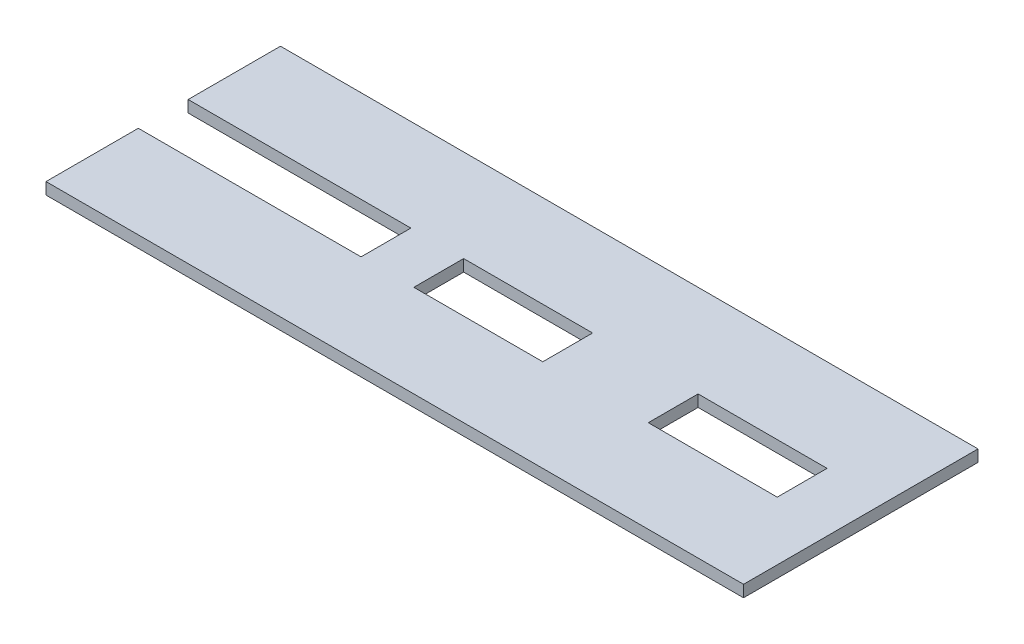
ISO-10303-21;
HEADER;
FILE_DESCRIPTION(('STEP AP214'),'2;1');
FILE_NAME('part.step','',(''),(''),'','','');
FILE_SCHEMA(('AUTOMOTIVE_DESIGN { 1 0 10303 214 1 1 1 1 }'));
ENDSEC;
DATA;
#1=APPLICATION_CONTEXT('core data for automotive mechanical design processes');
#2=APPLICATION_PROTOCOL_DEFINITION('international standard','automotive_design',2000,#1);
#3=PRODUCT_CONTEXT('',#1,'mechanical');
#4=PRODUCT('Part','Part','',(#3));
#5=PRODUCT_RELATED_PRODUCT_CATEGORY('part','',(#4));
#6=PRODUCT_DEFINITION_FORMATION('','',#4);
#7=PRODUCT_DEFINITION_CONTEXT('part definition',#1,'design');
#8=PRODUCT_DEFINITION('design','',#6,#7);
#9=PRODUCT_DEFINITION_SHAPE('','',#8);
#10=(LENGTH_UNIT() NAMED_UNIT(*) SI_UNIT(.MILLI.,.METRE.));
#11=(NAMED_UNIT(*) PLANE_ANGLE_UNIT() SI_UNIT($,.RADIAN.));
#12=(NAMED_UNIT(*) SI_UNIT($,.STERADIAN.) SOLID_ANGLE_UNIT());
#13=UNCERTAINTY_MEASURE_WITH_UNIT(LENGTH_MEASURE(1.E-05),#10,'distance_accuracy_value','');
#14=(GEOMETRIC_REPRESENTATION_CONTEXT(3) GLOBAL_UNCERTAINTY_ASSIGNED_CONTEXT((#13)) GLOBAL_UNIT_ASSIGNED_CONTEXT((#10,
#11,#12)) REPRESENTATION_CONTEXT('',''));
#15=CARTESIAN_POINT('',(0.,0.,0.));
#16=DIRECTION('',(0.,0.,1.));
#17=DIRECTION('',(1.,0.,0.));
#18=AXIS2_PLACEMENT_3D('',#15,#16,#17);
#19=CARTESIAN_POINT('',(0.,2.,0.));
#20=DIRECTION('',(1.,0.,0.));
#21=DIRECTION('',(0.,0.,-1.));
#22=AXIS2_PLACEMENT_3D('',#19,#20,#21);
#23=PLANE('',#22);
#24=DIRECTION('',(0.,0.,1.));
#25=VECTOR('',#24,1.);
#26=CARTESIAN_POINT('',(0.,0.,0.));
#27=LINE('',#26,#25);
#28=CARTESIAN_POINT('',(0.,0.,0.));
#29=VERTEX_POINT('',#28);
#30=CARTESIAN_POINT('',(0.,0.,15.75));
#31=VERTEX_POINT('',#30);
#32=EDGE_CURVE('E263',#29,#31,#27,.T.);
#33=ORIENTED_EDGE('',*,*,#32,.T.);
#34=DIRECTION('',(0.,1.,0.));
#35=VECTOR('',#34,1.);
#36=CARTESIAN_POINT('',(0.,0.,15.75));
#37=LINE('',#36,#35);
#38=CARTESIAN_POINT('',(0.,2.,15.75));
#39=VERTEX_POINT('',#38);
#40=EDGE_CURVE('E243',#31,#39,#37,.T.);
#41=ORIENTED_EDGE('',*,*,#40,.T.);
#42=DIRECTION('',(0.,0.,1.));
#43=VECTOR('',#42,1.);
#44=CARTESIAN_POINT('',(0.,2.,0.));
#45=LINE('',#44,#43);
#46=CARTESIAN_POINT('',(0.,2.,0.));
#47=VERTEX_POINT('',#46);
#48=EDGE_CURVE('E252',#47,#39,#45,.T.);
#49=ORIENTED_EDGE('',*,*,#48,.F.);
#50=DIRECTION('',(0.,-1.,0.));
#51=VECTOR('',#50,1.);
#52=CARTESIAN_POINT('',(0.,2.,0.));
#53=LINE('',#52,#51);
#54=EDGE_CURVE('E262',#47,#29,#53,.T.);
#55=ORIENTED_EDGE('',*,*,#54,.T.);
#56=EDGE_LOOP('',(#33,#41,#49,#55));
#57=FACE_BOUND('',#56,.T.);
#58=ADVANCED_FACE('F43',(#57),#23,.F.);
#59=CARTESIAN_POINT('',(0.,2.,24.25));
#60=VERTEX_POINT('',#59);
#61=CARTESIAN_POINT('',(0.,2.,40.));
#62=VERTEX_POINT('',#61);
#63=EDGE_CURVE('E256',#60,#62,#45,.T.);
#64=ORIENTED_EDGE('',*,*,#63,.F.);
#65=DIRECTION('',(0.,1.,0.));
#66=VECTOR('',#65,1.);
#67=CARTESIAN_POINT('',(0.,0.,24.25));
#68=LINE('',#67,#66);
#69=CARTESIAN_POINT('',(0.,0.,24.25));
#70=VERTEX_POINT('',#69);
#71=EDGE_CURVE('E236',#70,#60,#68,.T.);
#72=ORIENTED_EDGE('',*,*,#71,.F.);
#73=CARTESIAN_POINT('',(0.,0.,40.));
#74=VERTEX_POINT('',#73);
#75=EDGE_CURVE('E246',#70,#74,#27,.T.);
#76=ORIENTED_EDGE('',*,*,#75,.T.);
#77=DIRECTION('',(0.,-1.,0.));
#78=VECTOR('',#77,1.);
#79=CARTESIAN_POINT('',(0.,2.,40.));
#80=LINE('',#79,#78);
#81=EDGE_CURVE('E11',#62,#74,#80,.T.);
#82=ORIENTED_EDGE('',*,*,#81,.F.);
#83=EDGE_LOOP('',(#64,#72,#76,#82));
#84=FACE_BOUND('',#83,.T.);
#85=ADVANCED_FACE('F45',(#84),#23,.F.);
#86=CARTESIAN_POINT('',(0.,2.,40.));
#87=DIRECTION('',(0.,0.,-1.));
#88=DIRECTION('',(-1.,0.,0.));
#89=AXIS2_PLACEMENT_3D('',#86,#87,#88);
#90=PLANE('',#89);
#91=DIRECTION('',(1.,0.,0.));
#92=VECTOR('',#91,1.);
#93=CARTESIAN_POINT('',(0.,0.,40.));
#94=LINE('',#93,#92);
#95=CARTESIAN_POINT('',(119.,0.,40.));
#96=VERTEX_POINT('',#95);
#97=EDGE_CURVE('E266',#74,#96,#94,.T.);
#98=ORIENTED_EDGE('',*,*,#97,.T.);
#99=DIRECTION('',(0.,-1.,0.));
#100=VECTOR('',#99,1.);
#101=CARTESIAN_POINT('',(119.,2.,40.));
#102=LINE('',#101,#100);
#103=CARTESIAN_POINT('',(119.,2.,40.));
#104=VERTEX_POINT('',#103);
#105=EDGE_CURVE('E51',#104,#96,#102,.T.);
#106=ORIENTED_EDGE('',*,*,#105,.F.);
#107=DIRECTION('',(1.,0.,0.));
#108=VECTOR('',#107,1.);
#109=CARTESIAN_POINT('',(0.,2.,40.));
#110=LINE('',#109,#108);
#111=EDGE_CURVE('E255',#62,#104,#110,.T.);
#112=ORIENTED_EDGE('',*,*,#111,.F.);
#113=ORIENTED_EDGE('',*,*,#81,.T.);
#114=EDGE_LOOP('',(#98,#106,#112,#113));
#115=FACE_BOUND('',#114,.T.);
#116=ADVANCED_FACE('F303',(#115),#90,.F.);
#117=CARTESIAN_POINT('',(119.,2.,0.));
#118=DIRECTION('',(-1.,0.,0.));
#119=DIRECTION('',(0.,0.,1.));
#120=AXIS2_PLACEMENT_3D('',#117,#118,#119);
#121=PLANE('',#120);
#122=DIRECTION('',(0.,0.,-1.));
#123=VECTOR('',#122,1.);
#124=CARTESIAN_POINT('',(119.,0.,0.));
#125=LINE('',#124,#123);
#126=CARTESIAN_POINT('',(119.,0.,0.));
#127=VERTEX_POINT('',#126);
#128=EDGE_CURVE('E268',#96,#127,#125,.T.);
#129=ORIENTED_EDGE('',*,*,#128,.T.);
#130=DIRECTION('',(0.,-1.,0.));
#131=VECTOR('',#130,1.);
#132=CARTESIAN_POINT('',(119.,2.,0.));
#133=LINE('',#132,#131);
#134=CARTESIAN_POINT('',(119.,2.,0.));
#135=VERTEX_POINT('',#134);
#136=EDGE_CURVE('E274',#135,#127,#133,.T.);
#137=ORIENTED_EDGE('',*,*,#136,.F.);
#138=DIRECTION('',(0.,0.,-1.));
#139=VECTOR('',#138,1.);
#140=CARTESIAN_POINT('',(119.,2.,0.));
#141=LINE('',#140,#139);
#142=EDGE_CURVE('E258',#104,#135,#141,.T.);
#143=ORIENTED_EDGE('',*,*,#142,.F.);
#144=ORIENTED_EDGE('',*,*,#105,.T.);
#145=EDGE_LOOP('',(#129,#137,#143,#144));
#146=FACE_BOUND('',#145,.T.);
#147=ADVANCED_FACE('F281',(#146),#121,.F.);
#148=CARTESIAN_POINT('',(0.,2.,0.));
#149=DIRECTION('',(0.,0.,1.));
#150=DIRECTION('',(1.,0.,0.));
#151=AXIS2_PLACEMENT_3D('',#148,#149,#150);
#152=PLANE('',#151);
#153=DIRECTION('',(-1.,0.,0.));
#154=VECTOR('',#153,1.);
#155=CARTESIAN_POINT('',(0.,0.,0.));
#156=LINE('',#155,#154);
#157=EDGE_CURVE('E270',#127,#29,#156,.T.);
#158=ORIENTED_EDGE('',*,*,#157,.T.);
#159=ORIENTED_EDGE('',*,*,#54,.F.);
#160=DIRECTION('',(-1.,0.,0.));
#161=VECTOR('',#160,1.);
#162=CARTESIAN_POINT('',(0.,2.,0.));
#163=LINE('',#162,#161);
#164=EDGE_CURVE('E260',#135,#47,#163,.T.);
#165=ORIENTED_EDGE('',*,*,#164,.F.);
#166=ORIENTED_EDGE('',*,*,#136,.T.);
#167=EDGE_LOOP('',(#158,#159,#165,#166));
#168=FACE_BOUND('',#167,.T.);
#169=ADVANCED_FACE('F292',(#168),#152,.F.);
#170=CARTESIAN_POINT('',(0.,2.,0.));
#171=DIRECTION('',(0.,1.,0.));
#172=DIRECTION('',(0.,0.,1.));
#173=AXIS2_PLACEMENT_3D('',#170,#171,#172);
#174=PLANE('',#173);
#175=DIRECTION('',(0.,0.,1.));
#176=VECTOR('',#175,1.);
#177=CARTESIAN_POINT('',(47.,2.,15.75));
#178=LINE('',#177,#176);
#179=CARTESIAN_POINT('',(47.,2.,15.75));
#180=VERTEX_POINT('',#179);
#181=CARTESIAN_POINT('',(47.,2.,24.25));
#182=VERTEX_POINT('',#181);
#183=EDGE_CURVE('E58',#180,#182,#178,.T.);
#184=ORIENTED_EDGE('',*,*,#183,.F.);
#185=DIRECTION('',(-1.,0.,0.));
#186=VECTOR('',#185,1.);
#187=CARTESIAN_POINT('',(47.,2.,15.75));
#188=LINE('',#187,#186);
#189=CARTESIAN_POINT('',(69.,2.,15.75));
#190=VERTEX_POINT('',#189);
#191=EDGE_CURVE('E177',#190,#180,#188,.T.);
#192=ORIENTED_EDGE('',*,*,#191,.F.);
#193=DIRECTION('',(0.,0.,-1.));
#194=VECTOR('',#193,1.);
#195=CARTESIAN_POINT('',(69.,2.,15.75));
#196=LINE('',#195,#194);
#197=CARTESIAN_POINT('',(69.,2.,24.25));
#198=VERTEX_POINT('',#197);
#199=EDGE_CURVE('E180',#198,#190,#196,.T.);
#200=ORIENTED_EDGE('',*,*,#199,.F.);
#201=DIRECTION('',(1.,0.,0.));
#202=VECTOR('',#201,1.);
#203=CARTESIAN_POINT('',(47.,2.,24.25));
#204=LINE('',#203,#202);
#205=EDGE_CURVE('E186',#182,#198,#204,.T.);
#206=ORIENTED_EDGE('',*,*,#205,.F.);
#207=EDGE_LOOP('',(#184,#192,#200,#206));
#208=FACE_BOUND('',#207,.T.);
#209=DIRECTION('',(0.,0.,1.));
#210=VECTOR('',#209,1.);
#211=CARTESIAN_POINT('',(87.,2.,15.75));
#212=LINE('',#211,#210);
#213=CARTESIAN_POINT('',(87.,2.,15.75));
#214=VERTEX_POINT('',#213);
#215=CARTESIAN_POINT('',(87.,2.,24.25));
#216=VERTEX_POINT('',#215);
#217=EDGE_CURVE('E66',#214,#216,#212,.T.);
#218=ORIENTED_EDGE('',*,*,#217,.F.);
#219=DIRECTION('',(-1.,0.,0.));
#220=VECTOR('',#219,1.);
#221=CARTESIAN_POINT('',(87.,2.,15.75));
#222=LINE('',#221,#220);
#223=CARTESIAN_POINT('',(109.,2.,15.75));
#224=VERTEX_POINT('',#223);
#225=EDGE_CURVE('E205',#224,#214,#222,.T.);
#226=ORIENTED_EDGE('',*,*,#225,.F.);
#227=DIRECTION('',(0.,0.,-1.));
#228=VECTOR('',#227,1.);
#229=CARTESIAN_POINT('',(109.,2.,15.75));
#230=LINE('',#229,#228);
#231=CARTESIAN_POINT('',(109.,2.,24.25));
#232=VERTEX_POINT('',#231);
#233=EDGE_CURVE('E208',#232,#224,#230,.T.);
#234=ORIENTED_EDGE('',*,*,#233,.F.);
#235=DIRECTION('',(1.,0.,0.));
#236=VECTOR('',#235,1.);
#237=CARTESIAN_POINT('',(87.,2.,24.25));
#238=LINE('',#237,#236);
#239=EDGE_CURVE('E212',#216,#232,#238,.T.);
#240=ORIENTED_EDGE('',*,*,#239,.F.);
#241=EDGE_LOOP('',(#218,#226,#234,#240));
#242=FACE_BOUND('',#241,.T.);
#243=DIRECTION('',(-1.,0.,0.));
#244=VECTOR('',#243,1.);
#245=CARTESIAN_POINT('',(0.,2.,15.75));
#246=LINE('',#245,#244);
#247=CARTESIAN_POINT('',(38.,2.,15.75));
#248=VERTEX_POINT('',#247);
#249=EDGE_CURVE('E230',#248,#39,#246,.T.);
#250=ORIENTED_EDGE('',*,*,#249,.F.);
#251=DIRECTION('',(0.,0.,-1.));
#252=VECTOR('',#251,1.);
#253=CARTESIAN_POINT('',(38.,2.,24.25));
#254=LINE('',#253,#252);
#255=CARTESIAN_POINT('',(38.,2.,24.25));
#256=VERTEX_POINT('',#255);
#257=EDGE_CURVE('E239',#256,#248,#254,.T.);
#258=ORIENTED_EDGE('',*,*,#257,.F.);
#259=DIRECTION('',(1.,0.,0.));
#260=VECTOR('',#259,1.);
#261=CARTESIAN_POINT('',(0.,2.,24.25));
#262=LINE('',#261,#260);
#263=EDGE_CURVE('E192',#60,#256,#262,.T.);
#264=ORIENTED_EDGE('',*,*,#263,.F.);
#265=ORIENTED_EDGE('',*,*,#63,.T.);
#266=ORIENTED_EDGE('',*,*,#111,.T.);
#267=ORIENTED_EDGE('',*,*,#142,.T.);
#268=ORIENTED_EDGE('',*,*,#164,.T.);
#269=ORIENTED_EDGE('',*,*,#48,.T.);
#270=EDGE_LOOP('',(#250,#258,#264,#265,#266,#267,#268,#269));
#271=FACE_BOUND('',#270,.T.);
#272=ADVANCED_FACE('F298',(#208,#242,#271),#174,.T.);
#273=CARTESIAN_POINT('',(0.,0.,0.));
#274=DIRECTION('',(0.,1.,0.));
#275=DIRECTION('',(0.,0.,1.));
#276=AXIS2_PLACEMENT_3D('',#273,#274,#275);
#277=PLANE('',#276);
#278=DIRECTION('',(-1.,0.,0.));
#279=VECTOR('',#278,1.);
#280=CARTESIAN_POINT('',(47.,0.,15.75));
#281=LINE('',#280,#279);
#282=CARTESIAN_POINT('',(69.,0.,15.75));
#283=VERTEX_POINT('',#282);
#284=CARTESIAN_POINT('',(47.,0.,15.75));
#285=VERTEX_POINT('',#284);
#286=EDGE_CURVE('E164',#283,#285,#281,.T.);
#287=ORIENTED_EDGE('',*,*,#286,.T.);
#288=DIRECTION('',(0.,0.,1.));
#289=VECTOR('',#288,1.);
#290=CARTESIAN_POINT('',(47.,0.,15.75));
#291=LINE('',#290,#289);
#292=CARTESIAN_POINT('',(47.,0.,24.25));
#293=VERTEX_POINT('',#292);
#294=EDGE_CURVE('E158',#285,#293,#291,.T.);
#295=ORIENTED_EDGE('',*,*,#294,.T.);
#296=DIRECTION('',(1.,0.,0.));
#297=VECTOR('',#296,1.);
#298=CARTESIAN_POINT('',(47.,0.,24.25));
#299=LINE('',#298,#297);
#300=CARTESIAN_POINT('',(69.,0.,24.25));
#301=VERTEX_POINT('',#300);
#302=EDGE_CURVE('E168',#293,#301,#299,.T.);
#303=ORIENTED_EDGE('',*,*,#302,.T.);
#304=DIRECTION('',(0.,0.,-1.));
#305=VECTOR('',#304,1.);
#306=CARTESIAN_POINT('',(69.,0.,15.75));
#307=LINE('',#306,#305);
#308=EDGE_CURVE('E172',#301,#283,#307,.T.);
#309=ORIENTED_EDGE('',*,*,#308,.T.);
#310=EDGE_LOOP('',(#287,#295,#303,#309));
#311=FACE_BOUND('',#310,.T.);
#312=DIRECTION('',(-1.,0.,0.));
#313=VECTOR('',#312,1.);
#314=CARTESIAN_POINT('',(87.,0.,15.75));
#315=LINE('',#314,#313);
#316=CARTESIAN_POINT('',(109.,0.,15.75));
#317=VERTEX_POINT('',#316);
#318=CARTESIAN_POINT('',(87.,0.,15.75));
#319=VERTEX_POINT('',#318);
#320=EDGE_CURVE('E198',#317,#319,#315,.T.);
#321=ORIENTED_EDGE('',*,*,#320,.T.);
#322=DIRECTION('',(0.,0.,1.));
#323=VECTOR('',#322,1.);
#324=CARTESIAN_POINT('',(87.,0.,15.75));
#325=LINE('',#324,#323);
#326=CARTESIAN_POINT('',(87.,0.,24.25));
#327=VERTEX_POINT('',#326);
#328=EDGE_CURVE('E209',#319,#327,#325,.T.);
#329=ORIENTED_EDGE('',*,*,#328,.T.);
#330=DIRECTION('',(1.,0.,0.));
#331=VECTOR('',#330,1.);
#332=CARTESIAN_POINT('',(87.,0.,24.25));
#333=LINE('',#332,#331);
#334=CARTESIAN_POINT('',(109.,0.,24.25));
#335=VERTEX_POINT('',#334);
#336=EDGE_CURVE('E221',#327,#335,#333,.T.);
#337=ORIENTED_EDGE('',*,*,#336,.T.);
#338=DIRECTION('',(0.,0.,-1.));
#339=VECTOR('',#338,1.);
#340=CARTESIAN_POINT('',(109.,0.,15.75));
#341=LINE('',#340,#339);
#342=EDGE_CURVE('E218',#335,#317,#341,.T.);
#343=ORIENTED_EDGE('',*,*,#342,.T.);
#344=EDGE_LOOP('',(#321,#329,#337,#343));
#345=FACE_BOUND('',#344,.T.);
#346=DIRECTION('',(0.,0.,-1.));
#347=VECTOR('',#346,1.);
#348=CARTESIAN_POINT('',(38.,0.,24.25));
#349=LINE('',#348,#347);
#350=CARTESIAN_POINT('',(38.,0.,24.25));
#351=VERTEX_POINT('',#350);
#352=CARTESIAN_POINT('',(38.,0.,15.75));
#353=VERTEX_POINT('',#352);
#354=EDGE_CURVE('E229',#351,#353,#349,.T.);
#355=ORIENTED_EDGE('',*,*,#354,.T.);
#356=DIRECTION('',(-1.,0.,0.));
#357=VECTOR('',#356,1.);
#358=CARTESIAN_POINT('',(0.,0.,15.75));
#359=LINE('',#358,#357);
#360=EDGE_CURVE('E233',#353,#31,#359,.T.);
#361=ORIENTED_EDGE('',*,*,#360,.T.);
#362=ORIENTED_EDGE('',*,*,#32,.F.);
#363=ORIENTED_EDGE('',*,*,#157,.F.);
#364=ORIENTED_EDGE('',*,*,#128,.F.);
#365=ORIENTED_EDGE('',*,*,#97,.F.);
#366=ORIENTED_EDGE('',*,*,#75,.F.);
#367=DIRECTION('',(1.,0.,0.));
#368=VECTOR('',#367,1.);
#369=CARTESIAN_POINT('',(0.,0.,24.25));
#370=LINE('',#369,#368);
#371=EDGE_CURVE('E226',#70,#351,#370,.T.);
#372=ORIENTED_EDGE('',*,*,#371,.T.);
#373=EDGE_LOOP('',(#355,#361,#362,#363,#364,#365,#366,#372));
#374=FACE_BOUND('',#373,.T.);
#375=ADVANCED_FACE('F174',(#311,#345,#374),#277,.F.);
#376=CARTESIAN_POINT('',(0.,0.,15.75));
#377=DIRECTION('',(0.,0.,-1.));
#378=DIRECTION('',(-1.,0.,0.));
#379=AXIS2_PLACEMENT_3D('',#376,#377,#378);
#380=PLANE('',#379);
#381=ORIENTED_EDGE('',*,*,#249,.T.);
#382=ORIENTED_EDGE('',*,*,#40,.F.);
#383=ORIENTED_EDGE('',*,*,#360,.F.);
#384=DIRECTION('',(0.,1.,0.));
#385=VECTOR('',#384,1.);
#386=CARTESIAN_POINT('',(38.,0.,15.75));
#387=LINE('',#386,#385);
#388=EDGE_CURVE('E247',#353,#248,#387,.T.);
#389=ORIENTED_EDGE('',*,*,#388,.T.);
#390=EDGE_LOOP('',(#381,#382,#383,#389));
#391=FACE_BOUND('',#390,.T.);
#392=ADVANCED_FACE('F313',(#391),#380,.F.);
#393=CARTESIAN_POINT('',(38.,0.,24.25));
#394=DIRECTION('',(1.,0.,0.));
#395=DIRECTION('',(0.,0.,-1.));
#396=AXIS2_PLACEMENT_3D('',#393,#394,#395);
#397=PLANE('',#396);
#398=ORIENTED_EDGE('',*,*,#257,.T.);
#399=ORIENTED_EDGE('',*,*,#388,.F.);
#400=ORIENTED_EDGE('',*,*,#354,.F.);
#401=DIRECTION('',(0.,1.,0.));
#402=VECTOR('',#401,1.);
#403=CARTESIAN_POINT('',(38.,0.,24.25));
#404=LINE('',#403,#402);
#405=EDGE_CURVE('E249',#351,#256,#404,.T.);
#406=ORIENTED_EDGE('',*,*,#405,.T.);
#407=EDGE_LOOP('',(#398,#399,#400,#406));
#408=FACE_BOUND('',#407,.T.);
#409=ADVANCED_FACE('F310',(#408),#397,.F.);
#410=CARTESIAN_POINT('',(0.,0.,24.25));
#411=DIRECTION('',(0.,0.,1.));
#412=DIRECTION('',(1.,0.,0.));
#413=AXIS2_PLACEMENT_3D('',#410,#411,#412);
#414=PLANE('',#413);
#415=ORIENTED_EDGE('',*,*,#263,.T.);
#416=ORIENTED_EDGE('',*,*,#405,.F.);
#417=ORIENTED_EDGE('',*,*,#371,.F.);
#418=ORIENTED_EDGE('',*,*,#71,.T.);
#419=EDGE_LOOP('',(#415,#416,#417,#418));
#420=FACE_BOUND('',#419,.T.);
#421=ADVANCED_FACE('F308',(#420),#414,.F.);
#422=CARTESIAN_POINT('',(87.,0.,15.75));
#423=DIRECTION('',(-1.,0.,0.));
#424=DIRECTION('',(0.,0.,1.));
#425=AXIS2_PLACEMENT_3D('',#422,#423,#424);
#426=PLANE('',#425);
#427=ORIENTED_EDGE('',*,*,#217,.T.);
#428=DIRECTION('',(0.,1.,0.));
#429=VECTOR('',#428,1.);
#430=CARTESIAN_POINT('',(87.,0.,24.25));
#431=LINE('',#430,#429);
#432=EDGE_CURVE('E196',#327,#216,#431,.T.);
#433=ORIENTED_EDGE('',*,*,#432,.F.);
#434=ORIENTED_EDGE('',*,*,#328,.F.);
#435=DIRECTION('',(0.,1.,0.));
#436=VECTOR('',#435,1.);
#437=CARTESIAN_POINT('',(87.,0.,15.75));
#438=LINE('',#437,#436);
#439=EDGE_CURVE('E203',#319,#214,#438,.T.);
#440=ORIENTED_EDGE('',*,*,#439,.T.);
#441=EDGE_LOOP('',(#427,#433,#434,#440));
#442=FACE_BOUND('',#441,.T.);
#443=ADVANCED_FACE('F341',(#442),#426,.F.);
#444=CARTESIAN_POINT('',(87.,0.,15.75));
#445=DIRECTION('',(0.,0.,-1.));
#446=DIRECTION('',(-1.,0.,0.));
#447=AXIS2_PLACEMENT_3D('',#444,#445,#446);
#448=PLANE('',#447);
#449=ORIENTED_EDGE('',*,*,#225,.T.);
#450=ORIENTED_EDGE('',*,*,#439,.F.);
#451=ORIENTED_EDGE('',*,*,#320,.F.);
#452=DIRECTION('',(0.,1.,0.));
#453=VECTOR('',#452,1.);
#454=CARTESIAN_POINT('',(109.,0.,15.75));
#455=LINE('',#454,#453);
#456=EDGE_CURVE('E201',#317,#224,#455,.T.);
#457=ORIENTED_EDGE('',*,*,#456,.T.);
#458=EDGE_LOOP('',(#449,#450,#451,#457));
#459=FACE_BOUND('',#458,.T.);
#460=ADVANCED_FACE('F345',(#459),#448,.F.);
#461=CARTESIAN_POINT('',(109.,0.,15.75));
#462=DIRECTION('',(1.,0.,0.));
#463=DIRECTION('',(0.,0.,-1.));
#464=AXIS2_PLACEMENT_3D('',#461,#462,#463);
#465=PLANE('',#464);
#466=ORIENTED_EDGE('',*,*,#233,.T.);
#467=ORIENTED_EDGE('',*,*,#456,.F.);
#468=ORIENTED_EDGE('',*,*,#342,.F.);
#469=DIRECTION('',(0.,1.,0.));
#470=VECTOR('',#469,1.);
#471=CARTESIAN_POINT('',(109.,0.,24.25));
#472=LINE('',#471,#470);
#473=EDGE_CURVE('E199',#335,#232,#472,.T.);
#474=ORIENTED_EDGE('',*,*,#473,.T.);
#475=EDGE_LOOP('',(#466,#467,#468,#474));
#476=FACE_BOUND('',#475,.T.);
#477=ADVANCED_FACE('F350',(#476),#465,.F.);
#478=CARTESIAN_POINT('',(87.,0.,24.25));
#479=DIRECTION('',(0.,0.,1.));
#480=DIRECTION('',(1.,0.,0.));
#481=AXIS2_PLACEMENT_3D('',#478,#479,#480);
#482=PLANE('',#481);
#483=ORIENTED_EDGE('',*,*,#239,.T.);
#484=ORIENTED_EDGE('',*,*,#473,.F.);
#485=ORIENTED_EDGE('',*,*,#336,.F.);
#486=ORIENTED_EDGE('',*,*,#432,.T.);
#487=EDGE_LOOP('',(#483,#484,#485,#486));
#488=FACE_BOUND('',#487,.T.);
#489=ADVANCED_FACE('F355',(#488),#482,.F.);
#490=CARTESIAN_POINT('',(47.,0.,15.75));
#491=DIRECTION('',(-1.,0.,0.));
#492=DIRECTION('',(0.,0.,1.));
#493=AXIS2_PLACEMENT_3D('',#490,#491,#492);
#494=PLANE('',#493);
#495=ORIENTED_EDGE('',*,*,#183,.T.);
#496=DIRECTION('',(0.,1.,0.));
#497=VECTOR('',#496,1.);
#498=CARTESIAN_POINT('',(47.,0.,24.25));
#499=LINE('',#498,#497);
#500=EDGE_CURVE('E154',#293,#182,#499,.T.);
#501=ORIENTED_EDGE('',*,*,#500,.F.);
#502=ORIENTED_EDGE('',*,*,#294,.F.);
#503=DIRECTION('',(0.,1.,0.));
#504=VECTOR('',#503,1.);
#505=CARTESIAN_POINT('',(47.,0.,15.75));
#506=LINE('',#505,#504);
#507=EDGE_CURVE('E190',#285,#180,#506,.T.);
#508=ORIENTED_EDGE('',*,*,#507,.T.);
#509=EDGE_LOOP('',(#495,#501,#502,#508));
#510=FACE_BOUND('',#509,.T.);
#511=ADVANCED_FACE('F156',(#510),#494,.F.);
#512=CARTESIAN_POINT('',(47.,0.,15.75));
#513=DIRECTION('',(0.,0.,-1.));
#514=DIRECTION('',(-1.,0.,0.));
#515=AXIS2_PLACEMENT_3D('',#512,#513,#514);
#516=PLANE('',#515);
#517=ORIENTED_EDGE('',*,*,#191,.T.);
#518=ORIENTED_EDGE('',*,*,#507,.F.);
#519=ORIENTED_EDGE('',*,*,#286,.F.);
#520=DIRECTION('',(0.,1.,0.));
#521=VECTOR('',#520,1.);
#522=CARTESIAN_POINT('',(69.,0.,15.75));
#523=LINE('',#522,#521);
#524=EDGE_CURVE('E193',#283,#190,#523,.T.);
#525=ORIENTED_EDGE('',*,*,#524,.T.);
#526=EDGE_LOOP('',(#517,#518,#519,#525));
#527=FACE_BOUND('',#526,.T.);
#528=ADVANCED_FACE('F385',(#527),#516,.F.);
#529=CARTESIAN_POINT('',(69.,0.,15.75));
#530=DIRECTION('',(1.,0.,0.));
#531=DIRECTION('',(0.,0.,-1.));
#532=AXIS2_PLACEMENT_3D('',#529,#530,#531);
#533=PLANE('',#532);
#534=ORIENTED_EDGE('',*,*,#199,.T.);
#535=ORIENTED_EDGE('',*,*,#524,.F.);
#536=ORIENTED_EDGE('',*,*,#308,.F.);
#537=DIRECTION('',(0.,1.,0.));
#538=VECTOR('',#537,1.);
#539=CARTESIAN_POINT('',(69.,0.,24.25));
#540=LINE('',#539,#538);
#541=EDGE_CURVE('E163',#301,#198,#540,.T.);
#542=ORIENTED_EDGE('',*,*,#541,.T.);
#543=EDGE_LOOP('',(#534,#535,#536,#542));
#544=FACE_BOUND('',#543,.T.);
#545=ADVANCED_FACE('F392',(#544),#533,.F.);
#546=CARTESIAN_POINT('',(47.,0.,24.25));
#547=DIRECTION('',(0.,0.,1.));
#548=DIRECTION('',(1.,0.,0.));
#549=AXIS2_PLACEMENT_3D('',#546,#547,#548);
#550=PLANE('',#549);
#551=ORIENTED_EDGE('',*,*,#205,.T.);
#552=ORIENTED_EDGE('',*,*,#541,.F.);
#553=ORIENTED_EDGE('',*,*,#302,.F.);
#554=ORIENTED_EDGE('',*,*,#500,.T.);
#555=EDGE_LOOP('',(#551,#552,#553,#554));
#556=FACE_BOUND('',#555,.T.);
#557=ADVANCED_FACE('F169',(#556),#550,.F.);
#558=CLOSED_SHELL('',(#58,#85,#116,#147,#169,#272,#375,#392,#409,#421,#443,#460,#477,#489,#511,
#528,#545,#557));
#559=MANIFOLD_SOLID_BREP('B2',#558);
#560=ADVANCED_BREP_SHAPE_REPRESENTATION('',(#18,#559),#14);
#561=SHAPE_DEFINITION_REPRESENTATION(#9,#560);
ENDSEC;
END-ISO-10303-21;
